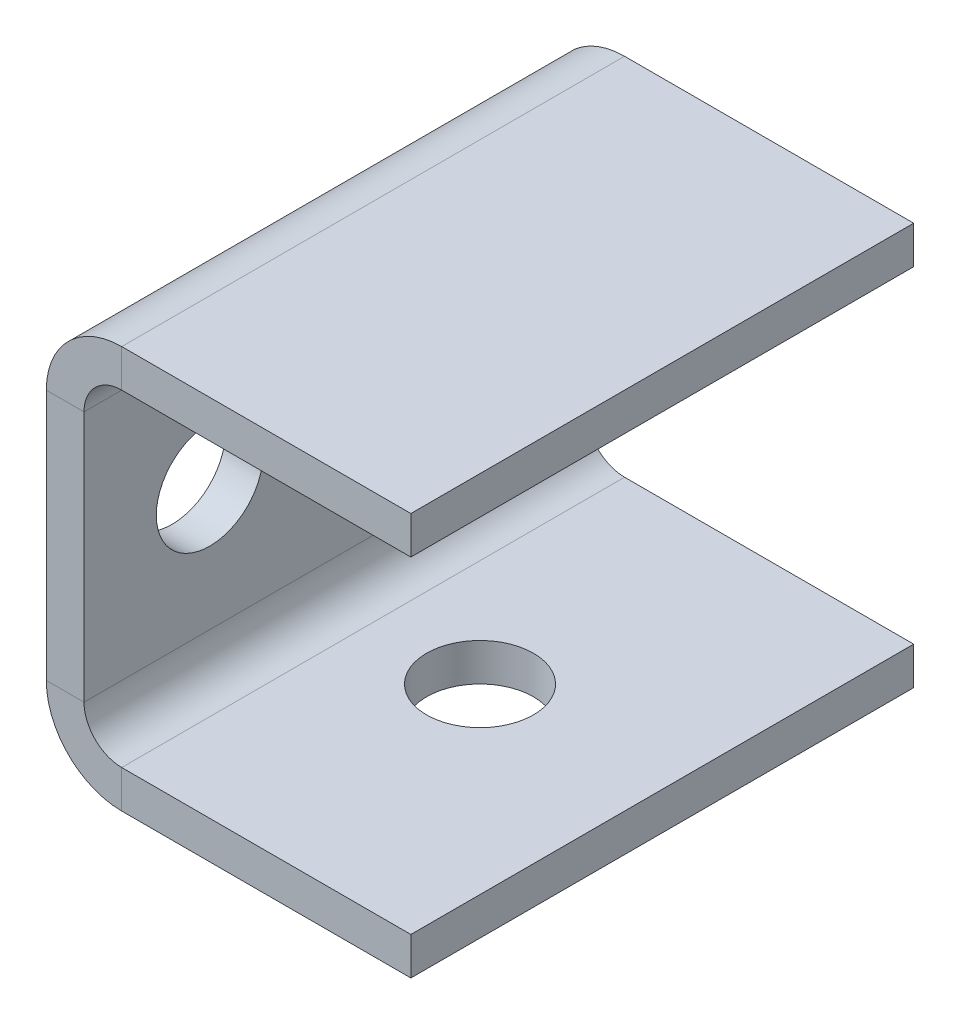
ISO-10303-21;
HEADER;
FILE_DESCRIPTION(('STEP AP214'),'2;1');
FILE_NAME('part.step','',(''),(''),'','','');
FILE_SCHEMA(('AUTOMOTIVE_DESIGN { 1 0 10303 214 1 1 1 1 }'));
ENDSEC;
DATA;
#1=APPLICATION_CONTEXT('core data for automotive mechanical design processes');
#2=APPLICATION_PROTOCOL_DEFINITION('international standard','automotive_design',2000,#1);
#3=PRODUCT_CONTEXT('',#1,'mechanical');
#4=PRODUCT('Part','Part','',(#3));
#5=PRODUCT_RELATED_PRODUCT_CATEGORY('part','',(#4));
#6=PRODUCT_DEFINITION_FORMATION('','',#4);
#7=PRODUCT_DEFINITION_CONTEXT('part definition',#1,'design');
#8=PRODUCT_DEFINITION('design','',#6,#7);
#9=PRODUCT_DEFINITION_SHAPE('','',#8);
#10=(LENGTH_UNIT() NAMED_UNIT(*) SI_UNIT(.MILLI.,.METRE.));
#11=(NAMED_UNIT(*) PLANE_ANGLE_UNIT() SI_UNIT($,.RADIAN.));
#12=(NAMED_UNIT(*) SI_UNIT($,.STERADIAN.) SOLID_ANGLE_UNIT());
#13=UNCERTAINTY_MEASURE_WITH_UNIT(LENGTH_MEASURE(1.E-05),#10,'distance_accuracy_value','');
#14=(GEOMETRIC_REPRESENTATION_CONTEXT(3) GLOBAL_UNCERTAINTY_ASSIGNED_CONTEXT((#13)) GLOBAL_UNIT_ASSIGNED_CONTEXT((#10,
#11,#12)) REPRESENTATION_CONTEXT('',''));
#15=CARTESIAN_POINT('',(0.,0.,0.));
#16=DIRECTION('',(0.,0.,1.));
#17=DIRECTION('',(1.,0.,0.));
#18=AXIS2_PLACEMENT_3D('',#15,#16,#17);
#19=CARTESIAN_POINT('',(5.99999999999928,-25.9999999999998,79.9999999999982));
#20=DIRECTION('',(0.,0.,0.999999999999996));
#21=DIRECTION('',(1.,0.,0.));
#22=AXIS2_PLACEMENT_3D('',#19,#20,#21);
#23=PLANE('',#22);
#24=DIRECTION('',(0.,-1.00000000000001,0.));
#25=VECTOR('',#24,1.);
#26=CARTESIAN_POINT('',(5.99999999999928,-25.9999999999998,79.9999999999982));
#27=LINE('',#26,#25);
#28=CARTESIAN_POINT('',(5.99999999999928,-25.9999999999998,79.9999999999982));
#29=VERTEX_POINT('',#28);
#30=CARTESIAN_POINT('',(5.99999999999956,-31.9999999999998,79.999999999999));
#31=VERTEX_POINT('',#30);
#32=EDGE_CURVE('E11',#29,#31,#27,.T.);
#33=ORIENTED_EDGE('',*,*,#32,.F.);
#34=CARTESIAN_POINT('',(5.99999999999928,-20.0000000000001,79.9999999999993));
#35=DIRECTION('',(0.,0.,0.999999999999996));
#36=DIRECTION('',(1.,0.,0.));
#37=AXIS2_PLACEMENT_3D('',#34,#35,#36);
#38=CIRCLE('',#37,6.);
#39=CARTESIAN_POINT('',(-7.21644966006352E-13,-20.0000000000001,79.999999999998));
#40=VERTEX_POINT('',#39);
#41=EDGE_CURVE('E155',#29,#40,#38,.F.);
#42=ORIENTED_EDGE('',*,*,#41,.T.);
#43=DIRECTION('',(1.,0.,0.));
#44=VECTOR('',#43,1.);
#45=CARTESIAN_POINT('',(-6.00000000000095,-20.,79.9999999999985));
#46=LINE('',#45,#44);
#47=CARTESIAN_POINT('',(-6.00000000000095,-20.,79.9999999999985));
#48=VERTEX_POINT('',#47);
#49=EDGE_CURVE('E51',#48,#40,#46,.T.);
#50=ORIENTED_EDGE('',*,*,#49,.F.);
#51=CARTESIAN_POINT('',(5.99999999999928,-20.0000000000001,79.9999999999993));
#52=DIRECTION('',(0.,0.,0.999999999999996));
#53=DIRECTION('',(1.,0.,0.));
#54=AXIS2_PLACEMENT_3D('',#51,#52,#53);
#55=CIRCLE('',#54,12.);
#56=EDGE_CURVE('E267',#31,#48,#55,.F.);
#57=ORIENTED_EDGE('',*,*,#56,.F.);
#58=EDGE_LOOP('',(#33,#42,#50,#57));
#59=FACE_BOUND('',#58,.T.);
#60=ADVANCED_FACE('F42',(#59),#23,.T.);
#61=CARTESIAN_POINT('',(-6.00000000000095,-20.,79.9999999999985));
#62=DIRECTION('',(0.,0.,0.999999999999996));
#63=DIRECTION('',(1.,0.,0.));
#64=AXIS2_PLACEMENT_3D('',#61,#62,#63);
#65=PLANE('',#64);
#66=DIRECTION('',(-1.,0.,0.));
#67=VECTOR('',#66,1.);
#68=CARTESIAN_POINT('',(-4.9960036108132E-13,-26.,79.9999999999985));
#69=LINE('',#68,#67);
#70=CARTESIAN_POINT('',(51.999999999999,-26.0000000000003,79.9999999999987));
#71=VERTEX_POINT('',#70);
#72=EDGE_CURVE('E160',#71,#29,#69,.T.);
#73=ORIENTED_EDGE('',*,*,#72,.T.);
#74=ORIENTED_EDGE('',*,*,#32,.T.);
#75=DIRECTION('',(1.,0.,0.));
#76=VECTOR('',#75,1.);
#77=CARTESIAN_POINT('',(-3.88578058618805E-13,-32.0000000000001,79.9999999999984));
#78=LINE('',#77,#76);
#79=CARTESIAN_POINT('',(51.9999999999994,-31.9999999999999,79.9999999999984));
#80=VERTEX_POINT('',#79);
#81=EDGE_CURVE('E269',#80,#31,#78,.F.);
#82=ORIENTED_EDGE('',*,*,#81,.F.);
#83=DIRECTION('',(0.,-1.00000000000001,0.));
#84=VECTOR('',#83,1.);
#85=CARTESIAN_POINT('',(51.999999999999,-26.0000000000003,79.9999999999987));
#86=LINE('',#85,#84);
#87=EDGE_CURVE('E272',#71,#80,#86,.T.);
#88=ORIENTED_EDGE('',*,*,#87,.F.);
#89=EDGE_LOOP('',(#73,#74,#82,#88));
#90=FACE_BOUND('',#89,.T.);
#91=ADVANCED_FACE('F278',(#90),#65,.T.);
#92=CARTESIAN_POINT('',(-2.22044604925031E-13,-19.9999999999999,-6.93889390390723E-13));
#93=DIRECTION('',(0.,0.,-0.999999999999996));
#94=DIRECTION('',(-1.,0.,0.));
#95=AXIS2_PLACEMENT_3D('',#92,#93,#94);
#96=PLANE('',#95);
#97=DIRECTION('',(-1.,0.,0.));
#98=VECTOR('',#97,1.);
#99=CARTESIAN_POINT('',(-2.22044604925031E-13,-19.9999999999999,-6.93889390390723E-13));
#100=LINE('',#99,#98);
#101=CARTESIAN_POINT('',(-2.22044604925031E-13,-19.9999999999999,-6.93889390390723E-13));
#102=VERTEX_POINT('',#101);
#103=CARTESIAN_POINT('',(-6.00000000000056,-20.,-1.52655665885959E-12));
#104=VERTEX_POINT('',#103);
#105=EDGE_CURVE('E152',#102,#104,#100,.T.);
#106=ORIENTED_EDGE('',*,*,#105,.F.);
#107=CARTESIAN_POINT('',(5.99999999999912,-20.0000000000001,-2.4980018054066E-13));
#108=DIRECTION('',(0.,0.,0.999999999999996));
#109=DIRECTION('',(1.,0.,0.));
#110=AXIS2_PLACEMENT_3D('',#107,#108,#109);
#111=CIRCLE('',#110,6.);
#112=CARTESIAN_POINT('',(5.99999999999934,-26.,-4.44089209850063E-13));
#113=VERTEX_POINT('',#112);
#114=EDGE_CURVE('E167',#113,#102,#111,.F.);
#115=ORIENTED_EDGE('',*,*,#114,.F.);
#116=DIRECTION('',(0.,1.00000000000001,0.));
#117=VECTOR('',#116,1.);
#118=CARTESIAN_POINT('',(5.99999999999962,-32.0000000000001,-2.22044604925031E-13));
#119=LINE('',#118,#117);
#120=CARTESIAN_POINT('',(5.99999999999962,-32.0000000000001,-2.22044604925031E-13));
#121=VERTEX_POINT('',#120);
#122=EDGE_CURVE('E241',#121,#113,#119,.T.);
#123=ORIENTED_EDGE('',*,*,#122,.F.);
#124=CARTESIAN_POINT('',(5.99999999999912,-20.0000000000001,-2.4980018054066E-13));
#125=DIRECTION('',(0.,0.,0.999999999999996));
#126=DIRECTION('',(1.,0.,0.));
#127=AXIS2_PLACEMENT_3D('',#124,#125,#126);
#128=CIRCLE('',#127,12.);
#129=EDGE_CURVE('E195',#121,#104,#128,.F.);
#130=ORIENTED_EDGE('',*,*,#129,.T.);
#131=EDGE_LOOP('',(#106,#115,#123,#130));
#132=FACE_BOUND('',#131,.T.);
#133=ADVANCED_FACE('F285',(#132),#96,.T.);
#134=CARTESIAN_POINT('',(5.99999999999962,-32.0000000000001,-2.22044604925031E-13));
#135=DIRECTION('',(0.,0.,-0.999999999999996));
#136=DIRECTION('',(-1.,0.,0.));
#137=AXIS2_PLACEMENT_3D('',#134,#135,#136);
#138=PLANE('',#137);
#139=DIRECTION('',(0.,1.00000000000001,0.));
#140=VECTOR('',#139,1.);
#141=CARTESIAN_POINT('',(-6.66133814775094E-13,26.,-2.22044604925031E-13));
#142=LINE('',#141,#140);
#143=CARTESIAN_POINT('',(-3.33066907387547E-13,20.0000000000002,-1.22124532708767E-12));
#144=VERTEX_POINT('',#143);
#145=EDGE_CURVE('E208',#102,#144,#142,.T.);
#146=ORIENTED_EDGE('',*,*,#145,.F.);
#147=ORIENTED_EDGE('',*,*,#105,.T.);
#148=DIRECTION('',(0.,1.00000000000001,0.));
#149=VECTOR('',#148,1.);
#150=CARTESIAN_POINT('',(-6.00000000000123,26.0000000000003,-1.30451205393456E-12));
#151=LINE('',#150,#149);
#152=CARTESIAN_POINT('',(-6.00000000000095,20.,-1.33226762955019E-12));
#153=VERTEX_POINT('',#152);
#154=EDGE_CURVE('E193',#104,#153,#151,.T.);
#155=ORIENTED_EDGE('',*,*,#154,.T.);
#156=DIRECTION('',(1.,0.,0.));
#157=VECTOR('',#156,1.);
#158=CARTESIAN_POINT('',(-6.00000000000095,20.,-1.33226762955019E-12));
#159=LINE('',#158,#157);
#160=EDGE_CURVE('E101',#153,#144,#159,.T.);
#161=ORIENTED_EDGE('',*,*,#160,.T.);
#162=EDGE_LOOP('',(#146,#147,#155,#161));
#163=FACE_BOUND('',#162,.T.);
#164=ADVANCED_FACE('F287',(#163),#138,.T.);
#165=CARTESIAN_POINT('',(-7.21644966006352E-13,20.0000000000001,79.999999999999));
#166=DIRECTION('',(0.,0.,0.999999999999996));
#167=DIRECTION('',(1.,0.,0.));
#168=AXIS2_PLACEMENT_3D('',#165,#166,#167);
#169=PLANE('',#168);
#170=DIRECTION('',(-1.,0.,0.));
#171=VECTOR('',#170,1.);
#172=CARTESIAN_POINT('',(-7.21644966006352E-13,20.0000000000001,79.999999999999));
#173=LINE('',#172,#171);
#174=CARTESIAN_POINT('',(-7.21644966006352E-13,20.0000000000001,79.999999999999));
#175=VERTEX_POINT('',#174);
#176=CARTESIAN_POINT('',(-6.00000000000078,19.9999999999999,79.9999999999984));
#177=VERTEX_POINT('',#176);
#178=EDGE_CURVE('E239',#175,#177,#173,.T.);
#179=ORIENTED_EDGE('',*,*,#178,.F.);
#180=CARTESIAN_POINT('',(5.99999999999906,20.0000000000001,79.9999999999986));
#181=DIRECTION('',(0.,0.,0.999999999999996));
#182=DIRECTION('',(1.,0.,0.));
#183=AXIS2_PLACEMENT_3D('',#180,#181,#182);
#184=CIRCLE('',#183,6.);
#185=CARTESIAN_POINT('',(5.99999999999928,25.9999999999997,79.999999999999));
#186=VERTEX_POINT('',#185);
#187=EDGE_CURVE('E175',#175,#186,#184,.F.);
#188=ORIENTED_EDGE('',*,*,#187,.T.);
#189=DIRECTION('',(0.,-1.00000000000001,0.));
#190=VECTOR('',#189,1.);
#191=CARTESIAN_POINT('',(5.99999999999917,32.0000000000006,79.9999999999979));
#192=LINE('',#191,#190);
#193=CARTESIAN_POINT('',(5.99999999999917,32.0000000000006,79.9999999999979));
#194=VERTEX_POINT('',#193);
#195=EDGE_CURVE('E60',#194,#186,#192,.T.);
#196=ORIENTED_EDGE('',*,*,#195,.F.);
#197=CARTESIAN_POINT('',(5.99999999999906,20.0000000000001,79.9999999999986));
#198=DIRECTION('',(0.,0.,0.999999999999996));
#199=DIRECTION('',(1.,0.,0.));
#200=AXIS2_PLACEMENT_3D('',#197,#198,#199);
#201=CIRCLE('',#200,12.);
#202=EDGE_CURVE('E263',#177,#194,#201,.F.);
#203=ORIENTED_EDGE('',*,*,#202,.F.);
#204=EDGE_LOOP('',(#179,#188,#196,#203));
#205=FACE_BOUND('',#204,.T.);
#206=ADVANCED_FACE('F334',(#205),#169,.T.);
#207=CARTESIAN_POINT('',(5.99999999999917,32.0000000000006,79.9999999999979));
#208=DIRECTION('',(0.,0.,0.999999999999996));
#209=DIRECTION('',(1.,0.,0.));
#210=AXIS2_PLACEMENT_3D('',#207,#208,#209);
#211=PLANE('',#210);
#212=DIRECTION('',(0.,1.00000000000001,0.));
#213=VECTOR('',#212,1.);
#214=CARTESIAN_POINT('',(-8.32667268468867E-13,26.,79.9999999999983));
#215=LINE('',#214,#213);
#216=EDGE_CURVE('E144',#40,#175,#215,.T.);
#217=ORIENTED_EDGE('',*,*,#216,.T.);
#218=ORIENTED_EDGE('',*,*,#178,.T.);
#219=DIRECTION('',(0.,1.00000000000001,0.));
#220=VECTOR('',#219,1.);
#221=CARTESIAN_POINT('',(-6.00000000000073,26.,79.9999999999986));
#222=LINE('',#221,#220);
#223=EDGE_CURVE('E147',#48,#177,#222,.T.);
#224=ORIENTED_EDGE('',*,*,#223,.F.);
#225=ORIENTED_EDGE('',*,*,#49,.T.);
#226=EDGE_LOOP('',(#217,#218,#224,#225));
#227=FACE_BOUND('',#226,.T.);
#228=ADVANCED_FACE('F142',(#227),#211,.T.);
#229=CARTESIAN_POINT('',(5.99999999999878,26.0000000000002,0.));
#230=DIRECTION('',(0.,0.,-0.999999999999996));
#231=DIRECTION('',(-1.,0.,0.));
#232=AXIS2_PLACEMENT_3D('',#229,#230,#231);
#233=PLANE('',#232);
#234=DIRECTION('',(0.,1.00000000000001,0.));
#235=VECTOR('',#234,1.);
#236=CARTESIAN_POINT('',(5.99999999999878,26.0000000000002,0.));
#237=LINE('',#236,#235);
#238=CARTESIAN_POINT('',(5.99999999999878,26.0000000000002,0.));
#239=VERTEX_POINT('',#238);
#240=CARTESIAN_POINT('',(5.99999999999912,32.,-1.0547118733939E-12));
#241=VERTEX_POINT('',#240);
#242=EDGE_CURVE('E108',#239,#241,#237,.T.);
#243=ORIENTED_EDGE('',*,*,#242,.F.);
#244=CARTESIAN_POINT('',(5.99999999999923,20.0000000000003,-5.55111512312578E-13));
#245=DIRECTION('',(0.,0.,0.999999999999996));
#246=DIRECTION('',(1.,0.,0.));
#247=AXIS2_PLACEMENT_3D('',#244,#245,#246);
#248=CIRCLE('',#247,6.);
#249=EDGE_CURVE('E210',#144,#239,#248,.F.);
#250=ORIENTED_EDGE('',*,*,#249,.F.);
#251=ORIENTED_EDGE('',*,*,#160,.F.);
#252=CARTESIAN_POINT('',(5.99999999999923,20.0000000000003,-5.55111512312578E-13));
#253=DIRECTION('',(0.,0.,0.999999999999996));
#254=DIRECTION('',(1.,0.,0.));
#255=AXIS2_PLACEMENT_3D('',#252,#253,#254);
#256=CIRCLE('',#255,12.);
#257=EDGE_CURVE('E191',#153,#241,#256,.F.);
#258=ORIENTED_EDGE('',*,*,#257,.T.);
#259=EDGE_LOOP('',(#243,#250,#251,#258));
#260=FACE_BOUND('',#259,.T.);
#261=ADVANCED_FACE('F300',(#260),#233,.T.);
#262=CARTESIAN_POINT('',(-6.00000000000095,20.,-1.33226762955019E-12));
#263=DIRECTION('',(0.,0.,-0.999999999999996));
#264=DIRECTION('',(-1.,0.,0.));
#265=AXIS2_PLACEMENT_3D('',#262,#263,#264);
#266=PLANE('',#265);
#267=DIRECTION('',(1.,0.,0.));
#268=VECTOR('',#267,1.);
#269=CARTESIAN_POINT('',(-6.66133814775094E-13,26.,-2.22044604925031E-13));
#270=LINE('',#269,#268);
#271=CARTESIAN_POINT('',(51.9999999999997,26.0000000000001,-1.94289029309402E-13));
#272=VERTEX_POINT('',#271);
#273=EDGE_CURVE('E181',#239,#272,#270,.T.);
#274=ORIENTED_EDGE('',*,*,#273,.F.);
#275=ORIENTED_EDGE('',*,*,#242,.T.);
#276=DIRECTION('',(1.,0.,0.));
#277=VECTOR('',#276,1.);
#278=CARTESIAN_POINT('',(-3.88578058618805E-13,32.0000000000002,0.));
#279=LINE('',#278,#277);
#280=CARTESIAN_POINT('',(51.999999999999,32.0000000000002,-1.94289029309402E-13));
#281=VERTEX_POINT('',#280);
#282=EDGE_CURVE('E188',#241,#281,#279,.T.);
#283=ORIENTED_EDGE('',*,*,#282,.T.);
#284=DIRECTION('',(0.,-1.00000000000001,0.));
#285=VECTOR('',#284,1.);
#286=CARTESIAN_POINT('',(51.999999999999,32.0000000000002,-1.94289029309402E-13));
#287=LINE('',#286,#285);
#288=EDGE_CURVE('E184',#281,#272,#287,.T.);
#289=ORIENTED_EDGE('',*,*,#288,.T.);
#290=EDGE_LOOP('',(#274,#275,#283,#289));
#291=FACE_BOUND('',#290,.T.);
#292=ADVANCED_FACE('F308',(#291),#266,.T.);
#293=CARTESIAN_POINT('',(-8.32667268468867E-13,26.,79.9999999999983));
#294=DIRECTION('',(0.,1.00000000000001,0.));
#295=DIRECTION('',(0.,0.,0.999999999999996));
#296=AXIS2_PLACEMENT_3D('',#293,#294,#295);
#297=PLANE('',#296);
#298=ORIENTED_EDGE('',*,*,#273,.T.);
#299=DIRECTION('',(0.,0.,-0.999999999999996));
#300=VECTOR('',#299,1.);
#301=CARTESIAN_POINT('',(51.9999999999993,25.9999999999998,79.9999999999986));
#302=LINE('',#301,#300);
#303=CARTESIAN_POINT('',(51.9999999999993,25.9999999999998,79.9999999999986));
#304=VERTEX_POINT('',#303);
#305=EDGE_CURVE('E234',#304,#272,#302,.T.);
#306=ORIENTED_EDGE('',*,*,#305,.F.);
#307=DIRECTION('',(1.,0.,0.));
#308=VECTOR('',#307,1.);
#309=CARTESIAN_POINT('',(-8.32667268468867E-13,26.,79.9999999999983));
#310=LINE('',#309,#308);
#311=EDGE_CURVE('E114',#186,#304,#310,.T.);
#312=ORIENTED_EDGE('',*,*,#311,.F.);
#313=DIRECTION('',(0.,0.,-0.999999999999996));
#314=VECTOR('',#313,1.);
#315=CARTESIAN_POINT('',(5.99999999999928,25.9999999999997,79.999999999999));
#316=LINE('',#315,#314);
#317=EDGE_CURVE('E177',#186,#239,#316,.T.);
#318=ORIENTED_EDGE('',*,*,#317,.T.);
#319=EDGE_LOOP('',(#298,#306,#312,#318));
#320=FACE_BOUND('',#319,.T.);
#321=ADVANCED_FACE('F306',(#320),#297,.F.);
#322=CARTESIAN_POINT('',(51.9999999999997,31.9999999999999,79.9999999999984));
#323=DIRECTION('',(1.,0.,0.));
#324=DIRECTION('',(0.,0.,-0.999999999999996));
#325=AXIS2_PLACEMENT_3D('',#322,#323,#324);
#326=PLANE('',#325);
#327=ORIENTED_EDGE('',*,*,#288,.F.);
#328=DIRECTION('',(0.,0.,-0.999999999999996));
#329=VECTOR('',#328,1.);
#330=CARTESIAN_POINT('',(51.9999999999997,31.9999999999999,79.9999999999984));
#331=LINE('',#330,#329);
#332=CARTESIAN_POINT('',(51.9999999999997,31.9999999999999,79.9999999999984));
#333=VERTEX_POINT('',#332);
#334=EDGE_CURVE('E232',#333,#281,#331,.T.);
#335=ORIENTED_EDGE('',*,*,#334,.F.);
#336=DIRECTION('',(0.,-1.00000000000001,0.));
#337=VECTOR('',#336,1.);
#338=CARTESIAN_POINT('',(51.9999999999997,31.9999999999999,79.9999999999984));
#339=LINE('',#338,#337);
#340=EDGE_CURVE('E257',#333,#304,#339,.T.);
#341=ORIENTED_EDGE('',*,*,#340,.T.);
#342=ORIENTED_EDGE('',*,*,#305,.T.);
#343=EDGE_LOOP('',(#327,#335,#341,#342));
#344=FACE_BOUND('',#343,.T.);
#345=ADVANCED_FACE('F311',(#344),#326,.T.);
#346=CARTESIAN_POINT('',(-7.21644966006352E-13,32.0000000000003,79.999999999999));
#347=DIRECTION('',(0.,1.00000000000001,0.));
#348=DIRECTION('',(0.,0.,0.999999999999996));
#349=AXIS2_PLACEMENT_3D('',#346,#347,#348);
#350=PLANE('',#349);
#351=ORIENTED_EDGE('',*,*,#282,.F.);
#352=DIRECTION('',(0.,0.,-0.999999999999996));
#353=VECTOR('',#352,1.);
#354=CARTESIAN_POINT('',(5.99999999999917,32.0000000000006,79.9999999999979));
#355=LINE('',#354,#353);
#356=EDGE_CURVE('E229',#194,#241,#355,.T.);
#357=ORIENTED_EDGE('',*,*,#356,.F.);
#358=DIRECTION('',(1.,0.,0.));
#359=VECTOR('',#358,1.);
#360=CARTESIAN_POINT('',(-7.21644966006352E-13,32.0000000000003,79.999999999999));
#361=LINE('',#360,#359);
#362=EDGE_CURVE('E260',#194,#333,#361,.T.);
#363=ORIENTED_EDGE('',*,*,#362,.T.);
#364=ORIENTED_EDGE('',*,*,#334,.T.);
#365=EDGE_LOOP('',(#351,#357,#363,#364));
#366=FACE_BOUND('',#365,.T.);
#367=ADVANCED_FACE('F314',(#366),#350,.T.);
#368=CARTESIAN_POINT('',(5.99999999999906,20.0000000000001,79.9999999999986));
#369=DIRECTION('',(0.,0.,-0.999999999999996));
#370=DIRECTION('',(-1.,0.,0.));
#371=AXIS2_PLACEMENT_3D('',#368,#369,#370);
#372=CYLINDRICAL_SURFACE('',#371,12.);
#373=ORIENTED_EDGE('',*,*,#257,.F.);
#374=DIRECTION('',(0.,0.,-0.999999999999996));
#375=VECTOR('',#374,1.);
#376=CARTESIAN_POINT('',(-6.00000000000078,19.9999999999999,79.9999999999984));
#377=LINE('',#376,#375);
#378=EDGE_CURVE('E226',#177,#153,#377,.T.);
#379=ORIENTED_EDGE('',*,*,#378,.F.);
#380=ORIENTED_EDGE('',*,*,#202,.T.);
#381=ORIENTED_EDGE('',*,*,#356,.T.);
#382=EDGE_LOOP('',(#373,#379,#380,#381));
#383=FACE_BOUND('',#382,.T.);
#384=ADVANCED_FACE('F297',(#383),#372,.T.);
#385=CARTESIAN_POINT('',(-6.00000000000073,26.,79.9999999999986));
#386=DIRECTION('',(-1.,0.,0.));
#387=DIRECTION('',(0.,0.,0.999999999999996));
#388=AXIS2_PLACEMENT_3D('',#385,#386,#387);
#389=PLANE('',#388);
#390=CARTESIAN_POINT('',(-6.00000000000033,4.5102810375397E-13,59.9999999999988));
#391=DIRECTION('',(-1.,0.,0.));
#392=DIRECTION('',(0.,0.,0.999999999999996));
#393=AXIS2_PLACEMENT_3D('',#390,#391,#392);
#394=CIRCLE('',#393,8.50000000000001);
#395=CARTESIAN_POINT('',(-6.00000000000033,4.51034993123444E-13,68.4999999999988));
#396=VERTEX_POINT('',#395);
#397=EDGE_CURVE('E252',#396,#396,#394,.T.);
#398=ORIENTED_EDGE('',*,*,#397,.F.);
#399=EDGE_LOOP('',(#398));
#400=FACE_BOUND('',#399,.T.);
#401=CARTESIAN_POINT('',(-6.00000000000057,1.87350135405495E-13,19.9999999999991));
#402=DIRECTION('',(-1.,0.,0.));
#403=DIRECTION('',(0.,0.,0.999999999999996));
#404=AXIS2_PLACEMENT_3D('',#401,#402,#403);
#405=CIRCLE('',#404,8.5);
#406=CARTESIAN_POINT('',(-6.00000000000057,1.87357024774969E-13,28.4999999999991));
#407=VERTEX_POINT('',#406);
#408=EDGE_CURVE('E244',#407,#407,#405,.T.);
#409=ORIENTED_EDGE('',*,*,#408,.F.);
#410=EDGE_LOOP('',(#409));
#411=FACE_BOUND('',#410,.T.);
#412=ORIENTED_EDGE('',*,*,#154,.F.);
#413=DIRECTION('',(0.,0.,-0.999999999999996));
#414=VECTOR('',#413,1.);
#415=CARTESIAN_POINT('',(-6.00000000000095,-20.,79.9999999999985));
#416=LINE('',#415,#414);
#417=EDGE_CURVE('E223',#48,#104,#416,.T.);
#418=ORIENTED_EDGE('',*,*,#417,.F.);
#419=ORIENTED_EDGE('',*,*,#223,.T.);
#420=ORIENTED_EDGE('',*,*,#378,.T.);
#421=EDGE_LOOP('',(#412,#418,#419,#420));
#422=FACE_BOUND('',#421,.T.);
#423=ADVANCED_FACE('F292',(#400,#411,#422),#389,.T.);
#424=CARTESIAN_POINT('',(5.99999999999928,-20.0000000000001,79.9999999999993));
#425=DIRECTION('',(0.,0.,-0.999999999999996));
#426=DIRECTION('',(-1.,0.,0.));
#427=AXIS2_PLACEMENT_3D('',#424,#425,#426);
#428=CYLINDRICAL_SURFACE('',#427,12.);
#429=ORIENTED_EDGE('',*,*,#129,.F.);
#430=DIRECTION('',(0.,0.,-0.999999999999996));
#431=VECTOR('',#430,1.);
#432=CARTESIAN_POINT('',(5.99999999999956,-31.9999999999998,79.999999999999));
#433=LINE('',#432,#431);
#434=EDGE_CURVE('E220',#31,#121,#433,.T.);
#435=ORIENTED_EDGE('',*,*,#434,.F.);
#436=ORIENTED_EDGE('',*,*,#56,.T.);
#437=ORIENTED_EDGE('',*,*,#417,.T.);
#438=EDGE_LOOP('',(#429,#435,#436,#437));
#439=FACE_BOUND('',#438,.T.);
#440=ADVANCED_FACE('F290',(#439),#428,.T.);
#441=CARTESIAN_POINT('',(-3.88578058618805E-13,-32.0000000000001,79.9999999999984));
#442=DIRECTION('',(0.,-1.00000000000001,0.));
#443=DIRECTION('',(0.,0.,-0.999999999999996));
#444=AXIS2_PLACEMENT_3D('',#441,#442,#443);
#445=PLANE('',#444);
#446=CARTESIAN_POINT('',(22.9999999999987,-32.0000000000004,39.9999999999992));
#447=DIRECTION('',(0.,-1.00000000000001,0.));
#448=DIRECTION('',(0.,0.,-0.999999999999996));
#449=AXIS2_PLACEMENT_3D('',#446,#447,#448);
#450=CIRCLE('',#449,8.5);
#451=CARTESIAN_POINT('',(22.9999999999987,-32.0000000000004,31.4999999999992));
#452=VERTEX_POINT('',#451);
#453=EDGE_CURVE('E582',#452,#452,#450,.T.);
#454=ORIENTED_EDGE('',*,*,#453,.F.);
#455=EDGE_LOOP('',(#454));
#456=FACE_BOUND('',#455,.T.);
#457=DIRECTION('',(1.,0.,0.));
#458=VECTOR('',#457,1.);
#459=CARTESIAN_POINT('',(-5.55111512312578E-13,-32.0000000000003,-6.66133814775094E-13));
#460=LINE('',#459,#458);
#461=CARTESIAN_POINT('',(51.9999999999991,-32.0000000000003,-1.19348975147204E-12));
#462=VERTEX_POINT('',#461);
#463=EDGE_CURVE('E198',#462,#121,#460,.F.);
#464=ORIENTED_EDGE('',*,*,#463,.F.);
#465=DIRECTION('',(0.,0.,-0.999999999999996));
#466=VECTOR('',#465,1.);
#467=CARTESIAN_POINT('',(51.9999999999994,-31.9999999999999,79.9999999999984));
#468=LINE('',#467,#466);
#469=EDGE_CURVE('E218',#80,#462,#468,.T.);
#470=ORIENTED_EDGE('',*,*,#469,.F.);
#471=ORIENTED_EDGE('',*,*,#81,.T.);
#472=ORIENTED_EDGE('',*,*,#434,.T.);
#473=EDGE_LOOP('',(#464,#470,#471,#472));
#474=FACE_BOUND('',#473,.T.);
#475=ADVANCED_FACE('F385',(#456,#474),#445,.T.);
#476=CARTESIAN_POINT('',(51.999999999999,-26.0000000000003,79.9999999999987));
#477=DIRECTION('',(1.,0.,0.));
#478=DIRECTION('',(0.,0.,-0.999999999999996));
#479=AXIS2_PLACEMENT_3D('',#476,#477,#478);
#480=PLANE('',#479);
#481=DIRECTION('',(0.,-1.00000000000001,0.));
#482=VECTOR('',#481,1.);
#483=CARTESIAN_POINT('',(51.9999999999993,-26.0000000000003,-6.38378239159465E-13));
#484=LINE('',#483,#482);
#485=CARTESIAN_POINT('',(51.9999999999993,-26.0000000000003,-6.38378239159465E-13));
#486=VERTEX_POINT('',#485);
#487=EDGE_CURVE('E201',#486,#462,#484,.T.);
#488=ORIENTED_EDGE('',*,*,#487,.F.);
#489=DIRECTION('',(0.,0.,-0.999999999999996));
#490=VECTOR('',#489,1.);
#491=CARTESIAN_POINT('',(51.999999999999,-26.0000000000003,79.9999999999987));
#492=LINE('',#491,#490);
#493=EDGE_CURVE('E216',#71,#486,#492,.T.);
#494=ORIENTED_EDGE('',*,*,#493,.F.);
#495=ORIENTED_EDGE('',*,*,#87,.T.);
#496=ORIENTED_EDGE('',*,*,#469,.T.);
#497=EDGE_LOOP('',(#488,#494,#495,#496));
#498=FACE_BOUND('',#497,.T.);
#499=ADVANCED_FACE('F395',(#498),#480,.T.);
#500=CARTESIAN_POINT('',(-4.9960036108132E-13,-26.,79.9999999999985));
#501=DIRECTION('',(0.,-1.00000000000001,0.));
#502=DIRECTION('',(0.,0.,-0.999999999999996));
#503=AXIS2_PLACEMENT_3D('',#500,#501,#502);
#504=PLANE('',#503);
#505=CARTESIAN_POINT('',(22.999999999999,-26.0000000000004,39.9999999999992));
#506=DIRECTION('',(0.,-1.00000000000001,0.));
#507=DIRECTION('',(0.,0.,-0.999999999999996));
#508=AXIS2_PLACEMENT_3D('',#505,#506,#507);
#509=CIRCLE('',#508,8.5);
#510=CARTESIAN_POINT('',(22.999999999999,-26.0000000000004,31.4999999999992));
#511=VERTEX_POINT('',#510);
#512=EDGE_CURVE('E585',#511,#511,#509,.F.);
#513=ORIENTED_EDGE('',*,*,#512,.F.);
#514=EDGE_LOOP('',(#513));
#515=FACE_BOUND('',#514,.T.);
#516=DIRECTION('',(-1.,0.,0.));
#517=VECTOR('',#516,1.);
#518=CARTESIAN_POINT('',(-7.21644966006352E-13,-25.9999999999999,-1.19348975147204E-12));
#519=LINE('',#518,#517);
#520=EDGE_CURVE('E204',#486,#113,#519,.T.);
#521=ORIENTED_EDGE('',*,*,#520,.T.);
#522=DIRECTION('',(0.,0.,-0.999999999999996));
#523=VECTOR('',#522,1.);
#524=CARTESIAN_POINT('',(5.99999999999928,-25.9999999999998,79.9999999999982));
#525=LINE('',#524,#523);
#526=EDGE_CURVE('E169',#29,#113,#525,.T.);
#527=ORIENTED_EDGE('',*,*,#526,.F.);
#528=ORIENTED_EDGE('',*,*,#72,.F.);
#529=ORIENTED_EDGE('',*,*,#493,.T.);
#530=EDGE_LOOP('',(#521,#527,#528,#529));
#531=FACE_BOUND('',#530,.T.);
#532=ADVANCED_FACE('F282',(#515,#531),#504,.F.);
#533=CARTESIAN_POINT('',(5.99999999999928,-20.0000000000001,79.9999999999993));
#534=DIRECTION('',(0.,0.,-0.999999999999996));
#535=DIRECTION('',(-1.,0.,0.));
#536=AXIS2_PLACEMENT_3D('',#533,#534,#535);
#537=CYLINDRICAL_SURFACE('',#536,6.);
#538=ORIENTED_EDGE('',*,*,#114,.T.);
#539=DIRECTION('',(0.,0.,-0.999999999999996));
#540=VECTOR('',#539,1.);
#541=CARTESIAN_POINT('',(-7.21644966006352E-13,-20.0000000000001,79.999999999998));
#542=LINE('',#541,#540);
#543=EDGE_CURVE('E164',#40,#102,#542,.T.);
#544=ORIENTED_EDGE('',*,*,#543,.F.);
#545=ORIENTED_EDGE('',*,*,#41,.F.);
#546=ORIENTED_EDGE('',*,*,#526,.T.);
#547=EDGE_LOOP('',(#538,#544,#545,#546));
#548=FACE_BOUND('',#547,.T.);
#549=ADVANCED_FACE('F165',(#548),#537,.F.);
#550=CARTESIAN_POINT('',(-8.32667268468867E-13,26.,79.9999999999983));
#551=DIRECTION('',(-1.,0.,0.));
#552=DIRECTION('',(0.,0.,0.999999999999996));
#553=AXIS2_PLACEMENT_3D('',#550,#551,#552);
#554=PLANE('',#553);
#555=CARTESIAN_POINT('',(-7.21644966006352E-13,0.,59.9999999999991));
#556=DIRECTION('',(-1.,0.,0.));
#557=DIRECTION('',(0.,0.,0.999999999999996));
#558=AXIS2_PLACEMENT_3D('',#555,#556,#557);
#559=CIRCLE('',#558,8.50000000000001);
#560=CARTESIAN_POINT('',(-7.21670414874811E-13,0.,68.4999999999991));
#561=VERTEX_POINT('',#560);
#562=EDGE_CURVE('E45',#561,#561,#559,.T.);
#563=ORIENTED_EDGE('',*,*,#562,.T.);
#564=EDGE_LOOP('',(#563));
#565=FACE_BOUND('',#564,.T.);
#566=CARTESIAN_POINT('',(-8.32667268468867E-13,-1.45716771982052E-13,19.9999999999994));
#567=DIRECTION('',(-1.,0.,0.));
#568=DIRECTION('',(0.,0.,0.999999999999996));
#569=AXIS2_PLACEMENT_3D('',#566,#567,#568);
#570=CIRCLE('',#569,8.5);
#571=CARTESIAN_POINT('',(-8.32692717337326E-13,-1.45709882612578E-13,28.4999999999993));
#572=VERTEX_POINT('',#571);
#573=EDGE_CURVE('E185',#572,#572,#570,.T.);
#574=ORIENTED_EDGE('',*,*,#573,.T.);
#575=EDGE_LOOP('',(#574));
#576=FACE_BOUND('',#575,.T.);
#577=ORIENTED_EDGE('',*,*,#145,.T.);
#578=DIRECTION('',(0.,0.,-0.999999999999996));
#579=VECTOR('',#578,1.);
#580=CARTESIAN_POINT('',(-7.21644966006352E-13,20.0000000000001,79.999999999999));
#581=LINE('',#580,#579);
#582=EDGE_CURVE('E170',#175,#144,#581,.T.);
#583=ORIENTED_EDGE('',*,*,#582,.F.);
#584=ORIENTED_EDGE('',*,*,#216,.F.);
#585=ORIENTED_EDGE('',*,*,#543,.T.);
#586=EDGE_LOOP('',(#577,#583,#584,#585));
#587=FACE_BOUND('',#586,.T.);
#588=ADVANCED_FACE('F172',(#565,#576,#587),#554,.F.);
#589=CARTESIAN_POINT('',(5.99999999999906,20.0000000000001,79.9999999999986));
#590=DIRECTION('',(0.,0.,-0.999999999999996));
#591=DIRECTION('',(-1.,0.,0.));
#592=AXIS2_PLACEMENT_3D('',#589,#590,#591);
#593=CYLINDRICAL_SURFACE('',#592,6.);
#594=ORIENTED_EDGE('',*,*,#249,.T.);
#595=ORIENTED_EDGE('',*,*,#317,.F.);
#596=ORIENTED_EDGE('',*,*,#187,.F.);
#597=ORIENTED_EDGE('',*,*,#582,.T.);
#598=EDGE_LOOP('',(#594,#595,#596,#597));
#599=FACE_BOUND('',#598,.T.);
#600=ADVANCED_FACE('F303',(#599),#593,.F.);
#601=CARTESIAN_POINT('',(5.99999999999906,20.0000000000001,79.9999999999986));
#602=DIRECTION('',(0.,0.,0.999999999999996));
#603=DIRECTION('',(1.,0.,0.));
#604=AXIS2_PLACEMENT_3D('',#601,#602,#603);
#605=PLANE('',#604);
#606=ORIENTED_EDGE('',*,*,#311,.T.);
#607=ORIENTED_EDGE('',*,*,#340,.F.);
#608=ORIENTED_EDGE('',*,*,#362,.F.);
#609=ORIENTED_EDGE('',*,*,#195,.T.);
#610=EDGE_LOOP('',(#606,#607,#608,#609));
#611=FACE_BOUND('',#610,.T.);
#612=ADVANCED_FACE('F312',(#611),#605,.T.);
#613=CARTESIAN_POINT('',(5.99999999999923,20.0000000000003,-5.55111512312578E-13));
#614=DIRECTION('',(0.,0.,0.999999999999996));
#615=DIRECTION('',(1.,0.,0.));
#616=AXIS2_PLACEMENT_3D('',#613,#614,#615);
#617=PLANE('',#616);
#618=ORIENTED_EDGE('',*,*,#463,.T.);
#619=ORIENTED_EDGE('',*,*,#122,.T.);
#620=ORIENTED_EDGE('',*,*,#520,.F.);
#621=ORIENTED_EDGE('',*,*,#487,.T.);
#622=EDGE_LOOP('',(#618,#619,#620,#621));
#623=FACE_BOUND('',#622,.T.);
#624=ADVANCED_FACE('F454',(#623),#617,.F.);
#625=CARTESIAN_POINT('',(51.9999999999994,2.28983498828939E-13,19.9999999999985));
#626=DIRECTION('',(-1.,0.,0.));
#627=DIRECTION('',(0.,0.,0.999999999999996));
#628=AXIS2_PLACEMENT_3D('',#625,#626,#627);
#629=CYLINDRICAL_SURFACE('',#628,8.5);
#630=ORIENTED_EDGE('',*,*,#408,.T.);
#631=EDGE_LOOP('',(#630));
#632=FACE_BOUND('',#631,.T.);
#633=ORIENTED_EDGE('',*,*,#573,.F.);
#634=EDGE_LOOP('',(#633));
#635=FACE_BOUND('',#634,.T.);
#636=ADVANCED_FACE('F464',(#632,#635),#629,.F.);
#637=CARTESIAN_POINT('',(51.9999999999997,-1.04083408558608E-13,59.9999999999982));
#638=DIRECTION('',(-1.,0.,0.));
#639=DIRECTION('',(0.,0.,0.999999999999996));
#640=AXIS2_PLACEMENT_3D('',#637,#638,#639);
#641=CYLINDRICAL_SURFACE('',#640,8.50000000000001);
#642=ORIENTED_EDGE('',*,*,#397,.T.);
#643=EDGE_LOOP('',(#642));
#644=FACE_BOUND('',#643,.T.);
#645=ORIENTED_EDGE('',*,*,#562,.F.);
#646=EDGE_LOOP('',(#645));
#647=FACE_BOUND('',#646,.T.);
#648=ADVANCED_FACE('F475',(#644,#647),#641,.F.);
#649=CARTESIAN_POINT('',(22.9999999999992,32.001,39.9999999999992));
#650=DIRECTION('',(0.,-1.00000000000001,0.));
#651=DIRECTION('',(0.,0.,-0.999999999999996));
#652=AXIS2_PLACEMENT_3D('',#649,#650,#651);
#653=CYLINDRICAL_SURFACE('',#652,8.5);
#654=ORIENTED_EDGE('',*,*,#453,.T.);
#655=EDGE_LOOP('',(#654));
#656=FACE_BOUND('',#655,.T.);
#657=ORIENTED_EDGE('',*,*,#512,.T.);
#658=EDGE_LOOP('',(#657));
#659=FACE_BOUND('',#658,.T.);
#660=ADVANCED_FACE('F485',(#656,#659),#653,.F.);
#661=CLOSED_SHELL('',(#60,#91,#133,#164,#206,#228,#261,#292,#321,#345,#367,#384,#423,#440,#475,
#499,#532,#549,#588,#600,#612,#624,#636,#648,#660));
#662=MANIFOLD_SOLID_BREP('B2',#661);
#663=ADVANCED_BREP_SHAPE_REPRESENTATION('',(#18,#662),#14);
#664=SHAPE_DEFINITION_REPRESENTATION(#9,#663);
ENDSEC;
END-ISO-10303-21;
